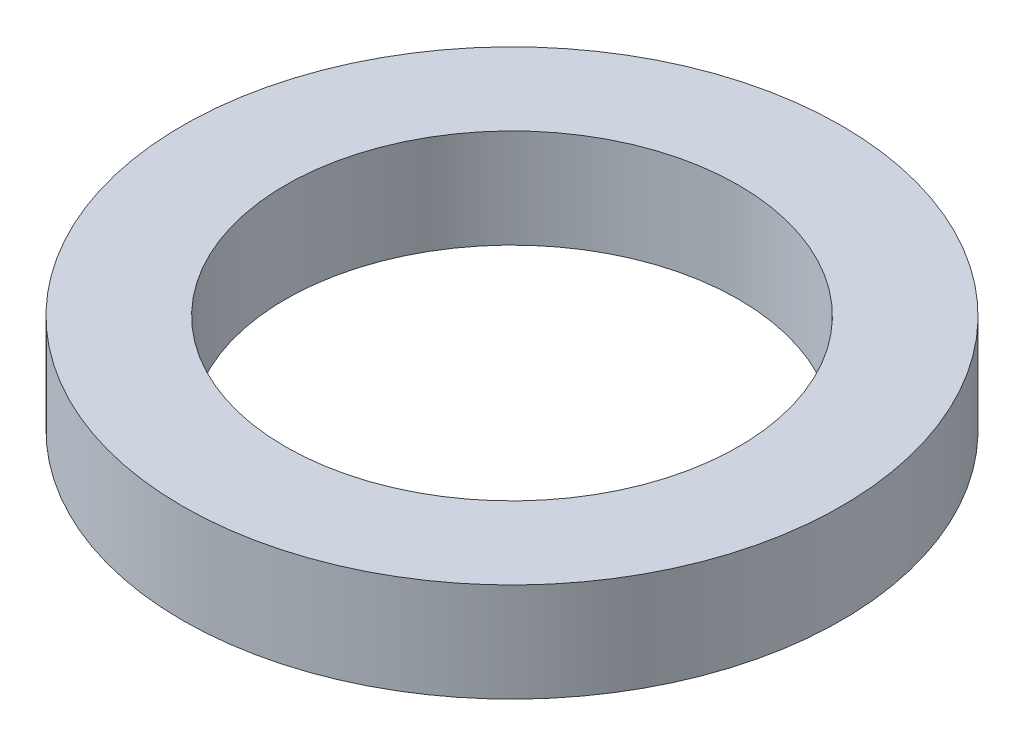
ISO-10303-21;
HEADER;
FILE_DESCRIPTION(('STEP AP214'),'2;1');
FILE_NAME('part.step','',(''),(''),'','','');
FILE_SCHEMA(('AUTOMOTIVE_DESIGN { 1 0 10303 214 1 1 1 1 }'));
ENDSEC;
DATA;
#1=APPLICATION_CONTEXT('core data for automotive mechanical design processes');
#2=APPLICATION_PROTOCOL_DEFINITION('international standard','automotive_design',2000,#1);
#3=PRODUCT_CONTEXT('',#1,'mechanical');
#4=PRODUCT('Part','Part','',(#3));
#5=PRODUCT_RELATED_PRODUCT_CATEGORY('part','',(#4));
#6=PRODUCT_DEFINITION_FORMATION('','',#4);
#7=PRODUCT_DEFINITION_CONTEXT('part definition',#1,'design');
#8=PRODUCT_DEFINITION('design','',#6,#7);
#9=PRODUCT_DEFINITION_SHAPE('','',#8);
#10=(LENGTH_UNIT() NAMED_UNIT(*) SI_UNIT(.MILLI.,.METRE.));
#11=(NAMED_UNIT(*) PLANE_ANGLE_UNIT() SI_UNIT($,.RADIAN.));
#12=(NAMED_UNIT(*) SI_UNIT($,.STERADIAN.) SOLID_ANGLE_UNIT());
#13=UNCERTAINTY_MEASURE_WITH_UNIT(LENGTH_MEASURE(1.E-05),#10,'distance_accuracy_value','');
#14=(GEOMETRIC_REPRESENTATION_CONTEXT(3) GLOBAL_UNCERTAINTY_ASSIGNED_CONTEXT((#13)) GLOBAL_UNIT_ASSIGNED_CONTEXT((#10,
#11,#12)) REPRESENTATION_CONTEXT('',''));
#15=CARTESIAN_POINT('',(0.,0.,0.));
#16=DIRECTION('',(0.,0.,1.));
#17=DIRECTION('',(1.,0.,0.));
#18=AXIS2_PLACEMENT_3D('',#15,#16,#17);
#19=CARTESIAN_POINT('',(0.,1.2,0.));
#20=DIRECTION('',(0.,1.,0.));
#21=DIRECTION('',(0.,0.,1.));
#22=AXIS2_PLACEMENT_3D('',#19,#20,#21);
#23=PLANE('',#22);
#24=CARTESIAN_POINT('',(0.,1.2,0.));
#25=DIRECTION('',(0.,1.,0.));
#26=DIRECTION('',(0.,0.,1.));
#27=AXIS2_PLACEMENT_3D('',#24,#25,#26);
#28=CIRCLE('',#27,4.);
#29=CARTESIAN_POINT('',(0.,1.2,4.));
#30=VERTEX_POINT('',#29);
#31=EDGE_CURVE('E10',#30,#30,#28,.T.);
#32=ORIENTED_EDGE('',*,*,#31,.T.);
#33=EDGE_LOOP('',(#32));
#34=FACE_BOUND('',#33,.T.);
#35=CARTESIAN_POINT('',(0.,1.2,0.));
#36=DIRECTION('',(0.,1.,0.));
#37=DIRECTION('',(0.,0.,1.));
#38=AXIS2_PLACEMENT_3D('',#35,#36,#37);
#39=CIRCLE('',#38,2.75);
#40=CARTESIAN_POINT('',(0.,1.2,2.75));
#41=VERTEX_POINT('',#40);
#42=EDGE_CURVE('E48',#41,#41,#39,.T.);
#43=ORIENTED_EDGE('',*,*,#42,.F.);
#44=EDGE_LOOP('',(#43));
#45=FACE_BOUND('',#44,.T.);
#46=ADVANCED_FACE('F37',(#34,#45),#23,.T.);
#47=CARTESIAN_POINT('',(0.,0.,0.));
#48=DIRECTION('',(0.,1.,0.));
#49=DIRECTION('',(0.,0.,1.));
#50=AXIS2_PLACEMENT_3D('',#47,#48,#49);
#51=PLANE('',#50);
#52=CARTESIAN_POINT('',(0.,0.,0.));
#53=DIRECTION('',(0.,1.,0.));
#54=DIRECTION('',(0.,0.,1.));
#55=AXIS2_PLACEMENT_3D('',#52,#53,#54);
#56=CIRCLE('',#55,4.);
#57=CARTESIAN_POINT('',(0.,0.,4.));
#58=VERTEX_POINT('',#57);
#59=EDGE_CURVE('E41',#58,#58,#56,.T.);
#60=ORIENTED_EDGE('',*,*,#59,.F.);
#61=EDGE_LOOP('',(#60));
#62=FACE_BOUND('',#61,.T.);
#63=CARTESIAN_POINT('',(0.,0.,0.));
#64=DIRECTION('',(0.,1.,0.));
#65=DIRECTION('',(0.,0.,1.));
#66=AXIS2_PLACEMENT_3D('',#63,#64,#65);
#67=CIRCLE('',#66,2.75);
#68=CARTESIAN_POINT('',(0.,0.,2.75));
#69=VERTEX_POINT('',#68);
#70=EDGE_CURVE('E50',#69,#69,#67,.T.);
#71=ORIENTED_EDGE('',*,*,#70,.T.);
#72=EDGE_LOOP('',(#71));
#73=FACE_BOUND('',#72,.T.);
#74=ADVANCED_FACE('F60',(#62,#73),#51,.F.);
#75=CARTESIAN_POINT('',(0.,1.2,0.));
#76=DIRECTION('',(0.,-1.,0.));
#77=DIRECTION('',(0.,0.,-1.));
#78=AXIS2_PLACEMENT_3D('',#75,#76,#77);
#79=CYLINDRICAL_SURFACE('',#78,4.);
#80=ORIENTED_EDGE('',*,*,#31,.F.);
#81=EDGE_LOOP('',(#80));
#82=FACE_BOUND('',#81,.T.);
#83=ORIENTED_EDGE('',*,*,#59,.T.);
#84=EDGE_LOOP('',(#83));
#85=FACE_BOUND('',#84,.T.);
#86=ADVANCED_FACE('F39',(#82,#85),#79,.T.);
#87=CARTESIAN_POINT('',(0.,1.2,0.));
#88=DIRECTION('',(0.,-1.,0.));
#89=DIRECTION('',(0.,0.,-1.));
#90=AXIS2_PLACEMENT_3D('',#87,#88,#89);
#91=CYLINDRICAL_SURFACE('',#90,2.75);
#92=ORIENTED_EDGE('',*,*,#42,.T.);
#93=EDGE_LOOP('',(#92));
#94=FACE_BOUND('',#93,.T.);
#95=ORIENTED_EDGE('',*,*,#70,.F.);
#96=EDGE_LOOP('',(#95));
#97=FACE_BOUND('',#96,.T.);
#98=ADVANCED_FACE('F56',(#94,#97),#91,.F.);
#99=CLOSED_SHELL('',(#46,#74,#86,#98));
#100=MANIFOLD_SOLID_BREP('B2',#99);
#101=ADVANCED_BREP_SHAPE_REPRESENTATION('',(#18,#100),#14);
#102=SHAPE_DEFINITION_REPRESENTATION(#9,#101);
ENDSEC;
END-ISO-10303-21;
